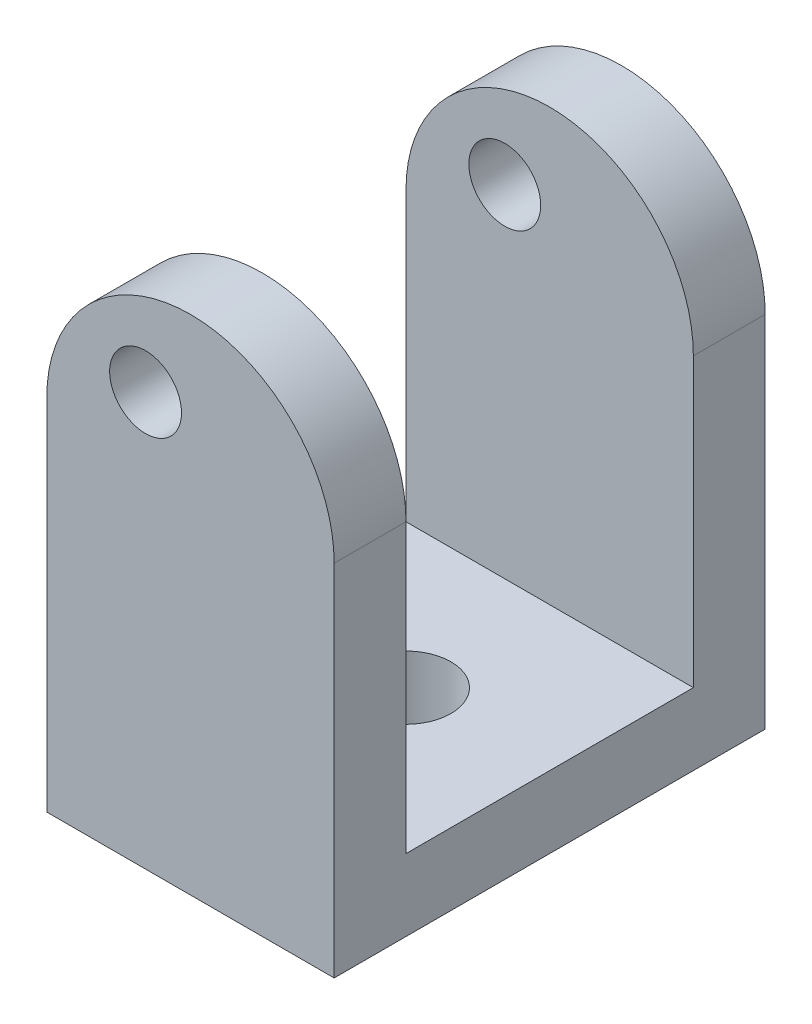
ISO-10303-21;
HEADER;
FILE_DESCRIPTION(('STEP AP214'),'2;1');
FILE_NAME('part.step','',(''),(''),'','','');
FILE_SCHEMA(('AUTOMOTIVE_DESIGN { 1 0 10303 214 1 1 1 1 }'));
ENDSEC;
DATA;
#1=APPLICATION_CONTEXT('core data for automotive mechanical design processes');
#2=APPLICATION_PROTOCOL_DEFINITION('international standard','automotive_design',2000,#1);
#3=PRODUCT_CONTEXT('',#1,'mechanical');
#4=PRODUCT('Part','Part','',(#3));
#5=PRODUCT_RELATED_PRODUCT_CATEGORY('part','',(#4));
#6=PRODUCT_DEFINITION_FORMATION('','',#4);
#7=PRODUCT_DEFINITION_CONTEXT('part definition',#1,'design');
#8=PRODUCT_DEFINITION('design','',#6,#7);
#9=PRODUCT_DEFINITION_SHAPE('','',#8);
#10=(LENGTH_UNIT() NAMED_UNIT(*) SI_UNIT(.MILLI.,.METRE.));
#11=(NAMED_UNIT(*) PLANE_ANGLE_UNIT() SI_UNIT($,.RADIAN.));
#12=(NAMED_UNIT(*) SI_UNIT($,.STERADIAN.) SOLID_ANGLE_UNIT());
#13=UNCERTAINTY_MEASURE_WITH_UNIT(LENGTH_MEASURE(1.E-05),#10,'distance_accuracy_value','');
#14=(GEOMETRIC_REPRESENTATION_CONTEXT(3) GLOBAL_UNCERTAINTY_ASSIGNED_CONTEXT((#13)) GLOBAL_UNIT_ASSIGNED_CONTEXT((#10,
#11,#12)) REPRESENTATION_CONTEXT('',''));
#15=CARTESIAN_POINT('',(0.,0.,0.));
#16=DIRECTION('',(0.,0.,1.));
#17=DIRECTION('',(1.,0.,0.));
#18=AXIS2_PLACEMENT_3D('',#15,#16,#17);
#19=CARTESIAN_POINT('',(-28.575,50.8,19.05));
#20=DIRECTION('',(1.,0.,0.));
#21=DIRECTION('',(0.,0.,-1.));
#22=AXIS2_PLACEMENT_3D('',#19,#20,#21);
#23=PLANE('',#22);
#24=DIRECTION('',(0.,0.,1.));
#25=VECTOR('',#24,1.);
#26=CARTESIAN_POINT('',(-28.575,31.75,-19.05));
#27=LINE('',#26,#25);
#28=CARTESIAN_POINT('',(-28.575,31.75,-19.05));
#29=VERTEX_POINT('',#28);
#30=CARTESIAN_POINT('',(-28.575,31.75,-12.7));
#31=VERTEX_POINT('',#30);
#32=EDGE_CURVE('E125',#29,#31,#27,.T.);
#33=ORIENTED_EDGE('',*,*,#32,.F.);
#34=DIRECTION('',(0.,-1.,0.));
#35=VECTOR('',#34,1.);
#36=CARTESIAN_POINT('',(-28.575,50.8,-19.05));
#37=LINE('',#36,#35);
#38=CARTESIAN_POINT('',(-28.575,0.,-19.05));
#39=VERTEX_POINT('',#38);
#40=EDGE_CURVE('E137',#29,#39,#37,.T.);
#41=ORIENTED_EDGE('',*,*,#40,.T.);
#42=DIRECTION('',(0.,0.,1.));
#43=VECTOR('',#42,1.);
#44=CARTESIAN_POINT('',(-28.575,0.,19.05));
#45=LINE('',#44,#43);
#46=CARTESIAN_POINT('',(-28.575,0.,19.05));
#47=VERTEX_POINT('',#46);
#48=EDGE_CURVE('E184',#39,#47,#45,.T.);
#49=ORIENTED_EDGE('',*,*,#48,.T.);
#50=DIRECTION('',(0.,-1.,0.));
#51=VECTOR('',#50,1.);
#52=CARTESIAN_POINT('',(-28.575,50.8,19.05));
#53=LINE('',#52,#51);
#54=CARTESIAN_POINT('',(-28.575,31.75,19.05));
#55=VERTEX_POINT('',#54);
#56=EDGE_CURVE('E79',#55,#47,#53,.T.);
#57=ORIENTED_EDGE('',*,*,#56,.F.);
#58=CARTESIAN_POINT('',(-28.575,31.75,12.7));
#59=VERTEX_POINT('',#58);
#60=EDGE_CURVE('E142',#59,#55,#27,.T.);
#61=ORIENTED_EDGE('',*,*,#60,.F.);
#62=DIRECTION('',(0.,1.,0.));
#63=VECTOR('',#62,1.);
#64=CARTESIAN_POINT('',(-28.575,50.8,12.7));
#65=LINE('',#64,#63);
#66=CARTESIAN_POINT('',(-28.575,6.35,12.7));
#67=VERTEX_POINT('',#66);
#68=EDGE_CURVE('E175',#67,#59,#65,.T.);
#69=ORIENTED_EDGE('',*,*,#68,.F.);
#70=DIRECTION('',(0.,0.,1.));
#71=VECTOR('',#70,1.);
#72=CARTESIAN_POINT('',(-28.575,6.35,-12.7));
#73=LINE('',#72,#71);
#74=CARTESIAN_POINT('',(-28.575,6.35,-12.7));
#75=VERTEX_POINT('',#74);
#76=EDGE_CURVE('E172',#75,#67,#73,.T.);
#77=ORIENTED_EDGE('',*,*,#76,.F.);
#78=DIRECTION('',(0.,-1.,0.));
#79=VECTOR('',#78,1.);
#80=CARTESIAN_POINT('',(-28.575,50.8,-12.7));
#81=LINE('',#80,#79);
#82=EDGE_CURVE('E140',#31,#75,#81,.T.);
#83=ORIENTED_EDGE('',*,*,#82,.F.);
#84=EDGE_LOOP('',(#33,#41,#49,#57,#61,#69,#77,#83));
#85=FACE_BOUND('',#84,.T.);
#86=ADVANCED_FACE('F55',(#85),#23,.F.);
#87=CARTESIAN_POINT('',(-28.575,50.8,-19.05));
#88=DIRECTION('',(0.,0.,1.));
#89=DIRECTION('',(1.,0.,0.));
#90=AXIS2_PLACEMENT_3D('',#87,#88,#89);
#91=PLANE('',#90);
#92=CARTESIAN_POINT('',(-19.84375,36.5125,-19.05));
#93=DIRECTION('',(0.,0.,1.));
#94=DIRECTION('',(1.,0.,0.));
#95=AXIS2_PLACEMENT_3D('',#92,#93,#94);
#96=CIRCLE('',#95,3.175);
#97=CARTESIAN_POINT('',(-16.66875,36.5125,-19.05));
#98=VERTEX_POINT('',#97);
#99=EDGE_CURVE('E166',#98,#98,#96,.T.);
#100=ORIENTED_EDGE('',*,*,#99,.T.);
#101=EDGE_LOOP('',(#100));
#102=FACE_BOUND('',#101,.T.);
#103=CARTESIAN_POINT('',(-15.875,31.75,-19.05));
#104=DIRECTION('',(0.,0.,1.));
#105=DIRECTION('',(1.,0.,0.));
#106=AXIS2_PLACEMENT_3D('',#103,#104,#105);
#107=CIRCLE('',#106,12.7);
#108=CARTESIAN_POINT('',(-3.17500000000001,31.75,-19.05));
#109=VERTEX_POINT('',#108);
#110=EDGE_CURVE('E122',#109,#29,#107,.T.);
#111=ORIENTED_EDGE('',*,*,#110,.F.);
#112=DIRECTION('',(0.,-1.,0.));
#113=VECTOR('',#112,1.);
#114=CARTESIAN_POINT('',(-3.175,0.,-19.05));
#115=LINE('',#114,#113);
#116=CARTESIAN_POINT('',(-3.17500000000001,0.,-19.05));
#117=VERTEX_POINT('',#116);
#118=EDGE_CURVE('E132',#109,#117,#115,.T.);
#119=ORIENTED_EDGE('',*,*,#118,.T.);
#120=DIRECTION('',(-1.,0.,0.));
#121=VECTOR('',#120,1.);
#122=CARTESIAN_POINT('',(-28.575,0.,-19.05));
#123=LINE('',#122,#121);
#124=EDGE_CURVE('E145',#117,#39,#123,.T.);
#125=ORIENTED_EDGE('',*,*,#124,.T.);
#126=ORIENTED_EDGE('',*,*,#40,.F.);
#127=EDGE_LOOP('',(#111,#119,#125,#126));
#128=FACE_BOUND('',#127,.T.);
#129=ADVANCED_FACE('F57',(#102,#128),#91,.F.);
#130=CARTESIAN_POINT('',(-28.575,50.8,19.05));
#131=DIRECTION('',(0.,0.,-1.));
#132=DIRECTION('',(-1.,0.,0.));
#133=AXIS2_PLACEMENT_3D('',#130,#131,#132);
#134=PLANE('',#133);
#135=CARTESIAN_POINT('',(-19.84375,36.5125,19.05));
#136=DIRECTION('',(0.,0.,1.));
#137=DIRECTION('',(1.,0.,0.));
#138=AXIS2_PLACEMENT_3D('',#135,#136,#137);
#139=CIRCLE('',#138,3.175);
#140=CARTESIAN_POINT('',(-16.66875,36.5125,19.05));
#141=VERTEX_POINT('',#140);
#142=EDGE_CURVE('E192',#141,#141,#139,.T.);
#143=ORIENTED_EDGE('',*,*,#142,.F.);
#144=EDGE_LOOP('',(#143));
#145=FACE_BOUND('',#144,.T.);
#146=DIRECTION('',(1.,0.,0.));
#147=VECTOR('',#146,1.);
#148=CARTESIAN_POINT('',(-28.575,0.,19.05));
#149=LINE('',#148,#147);
#150=CARTESIAN_POINT('',(-3.17500000000001,0.,19.05));
#151=VERTEX_POINT('',#150);
#152=EDGE_CURVE('E149',#47,#151,#149,.T.);
#153=ORIENTED_EDGE('',*,*,#152,.T.);
#154=DIRECTION('',(0.,-1.,0.));
#155=VECTOR('',#154,1.);
#156=CARTESIAN_POINT('',(-3.175,0.,19.05));
#157=LINE('',#156,#155);
#158=CARTESIAN_POINT('',(-3.17500000000001,31.75,19.05));
#159=VERTEX_POINT('',#158);
#160=EDGE_CURVE('E133',#159,#151,#157,.T.);
#161=ORIENTED_EDGE('',*,*,#160,.F.);
#162=CARTESIAN_POINT('',(-15.875,31.75,19.05));
#163=DIRECTION('',(0.,0.,1.));
#164=DIRECTION('',(1.,0.,0.));
#165=AXIS2_PLACEMENT_3D('',#162,#163,#164);
#166=CIRCLE('',#165,12.7);
#167=EDGE_CURVE('E227',#159,#55,#166,.T.);
#168=ORIENTED_EDGE('',*,*,#167,.T.);
#169=ORIENTED_EDGE('',*,*,#56,.T.);
#170=EDGE_LOOP('',(#153,#161,#168,#169));
#171=FACE_BOUND('',#170,.T.);
#172=ADVANCED_FACE('F187',(#145,#171),#134,.F.);
#173=CARTESIAN_POINT('',(0.,0.,0.));
#174=DIRECTION('',(0.,-1.,0.));
#175=DIRECTION('',(0.,0.,-1.));
#176=AXIS2_PLACEMENT_3D('',#173,#174,#175);
#177=PLANE('',#176);
#178=CARTESIAN_POINT('',(-15.875,0.,0.));
#179=DIRECTION('',(0.,-1.,0.));
#180=DIRECTION('',(0.,0.,-1.));
#181=AXIS2_PLACEMENT_3D('',#178,#179,#180);
#182=CIRCLE('',#181,3.96875);
#183=CARTESIAN_POINT('',(-15.875,0.,-3.96875));
#184=VERTEX_POINT('',#183);
#185=EDGE_CURVE('E229',#184,#184,#182,.T.);
#186=ORIENTED_EDGE('',*,*,#185,.F.);
#187=EDGE_LOOP('',(#186));
#188=FACE_BOUND('',#187,.T.);
#189=DIRECTION('',(0.,0.,1.));
#190=VECTOR('',#189,1.);
#191=CARTESIAN_POINT('',(-3.17500000000001,0.,-19.05));
#192=LINE('',#191,#190);
#193=EDGE_CURVE('E191',#117,#151,#192,.T.);
#194=ORIENTED_EDGE('',*,*,#193,.T.);
#195=ORIENTED_EDGE('',*,*,#152,.F.);
#196=ORIENTED_EDGE('',*,*,#48,.F.);
#197=ORIENTED_EDGE('',*,*,#124,.F.);
#198=EDGE_LOOP('',(#194,#195,#196,#197));
#199=FACE_BOUND('',#198,.T.);
#200=ADVANCED_FACE('F190',(#188,#199),#177,.T.);
#201=CARTESIAN_POINT('',(28.575,50.8,-12.7));
#202=DIRECTION('',(0.,0.,-1.));
#203=DIRECTION('',(0.,1.,0.));
#204=AXIS2_PLACEMENT_3D('',#201,#202,#203);
#205=PLANE('',#204);
#206=CARTESIAN_POINT('',(-19.84375,36.5125,-12.7));
#207=DIRECTION('',(0.,0.,-1.));
#208=DIRECTION('',(0.,1.,0.));
#209=AXIS2_PLACEMENT_3D('',#206,#207,#208);
#210=CIRCLE('',#209,3.175);
#211=CARTESIAN_POINT('',(-19.84375,39.6875,-12.7));
#212=VERTEX_POINT('',#211);
#213=EDGE_CURVE('E155',#212,#212,#210,.T.);
#214=ORIENTED_EDGE('',*,*,#213,.T.);
#215=EDGE_LOOP('',(#214));
#216=FACE_BOUND('',#215,.T.);
#217=DIRECTION('',(-1.,0.,0.));
#218=VECTOR('',#217,1.);
#219=CARTESIAN_POINT('',(28.575,6.35,-12.7));
#220=LINE('',#219,#218);
#221=CARTESIAN_POINT('',(-3.17499999999999,6.35,-12.7));
#222=VERTEX_POINT('',#221);
#223=EDGE_CURVE('E178',#222,#75,#220,.T.);
#224=ORIENTED_EDGE('',*,*,#223,.F.);
#225=DIRECTION('',(0.,1.,0.));
#226=VECTOR('',#225,1.);
#227=CARTESIAN_POINT('',(-3.17500000000002,50.8,-12.7));
#228=LINE('',#227,#226);
#229=CARTESIAN_POINT('',(-3.17500000000001,31.75,-12.7));
#230=VERTEX_POINT('',#229);
#231=EDGE_CURVE('E71',#222,#230,#228,.T.);
#232=ORIENTED_EDGE('',*,*,#231,.T.);
#233=CARTESIAN_POINT('',(-15.875,31.75,-12.7));
#234=DIRECTION('',(0.,0.,-1.));
#235=DIRECTION('',(0.,1.,0.));
#236=AXIS2_PLACEMENT_3D('',#233,#234,#235);
#237=CIRCLE('',#236,12.7);
#238=EDGE_CURVE('E159',#31,#230,#237,.T.);
#239=ORIENTED_EDGE('',*,*,#238,.F.);
#240=ORIENTED_EDGE('',*,*,#82,.T.);
#241=EDGE_LOOP('',(#224,#232,#239,#240));
#242=FACE_BOUND('',#241,.T.);
#243=ADVANCED_FACE('F211',(#216,#242),#205,.F.);
#244=CARTESIAN_POINT('',(28.575,50.8,12.7));
#245=DIRECTION('',(0.,0.,1.));
#246=DIRECTION('',(0.,-1.,0.));
#247=AXIS2_PLACEMENT_3D('',#244,#245,#246);
#248=PLANE('',#247);
#249=CARTESIAN_POINT('',(-19.84375,36.5125,12.7));
#250=DIRECTION('',(0.,0.,1.));
#251=DIRECTION('',(0.,-1.,0.));
#252=AXIS2_PLACEMENT_3D('',#249,#250,#251);
#253=CIRCLE('',#252,3.175);
#254=CARTESIAN_POINT('',(-19.84375,33.3375,12.7));
#255=VERTEX_POINT('',#254);
#256=EDGE_CURVE('E153',#255,#255,#253,.T.);
#257=ORIENTED_EDGE('',*,*,#256,.T.);
#258=EDGE_LOOP('',(#257));
#259=FACE_BOUND('',#258,.T.);
#260=CARTESIAN_POINT('',(-15.875,31.75,12.7));
#261=DIRECTION('',(0.,0.,1.));
#262=DIRECTION('',(0.,-1.,0.));
#263=AXIS2_PLACEMENT_3D('',#260,#261,#262);
#264=CIRCLE('',#263,12.7);
#265=CARTESIAN_POINT('',(-3.17500000000001,31.75,12.7));
#266=VERTEX_POINT('',#265);
#267=EDGE_CURVE('E12',#266,#59,#264,.T.);
#268=ORIENTED_EDGE('',*,*,#267,.F.);
#269=DIRECTION('',(0.,-1.,0.));
#270=VECTOR('',#269,1.);
#271=CARTESIAN_POINT('',(-3.17500000000002,50.8,12.7));
#272=LINE('',#271,#270);
#273=CARTESIAN_POINT('',(-3.175,6.35,12.7));
#274=VERTEX_POINT('',#273);
#275=EDGE_CURVE('E161',#266,#274,#272,.T.);
#276=ORIENTED_EDGE('',*,*,#275,.T.);
#277=DIRECTION('',(-1.,0.,0.));
#278=VECTOR('',#277,1.);
#279=CARTESIAN_POINT('',(28.575,6.35,12.7));
#280=LINE('',#279,#278);
#281=EDGE_CURVE('E179',#274,#67,#280,.T.);
#282=ORIENTED_EDGE('',*,*,#281,.T.);
#283=ORIENTED_EDGE('',*,*,#68,.T.);
#284=EDGE_LOOP('',(#268,#276,#282,#283));
#285=FACE_BOUND('',#284,.T.);
#286=ADVANCED_FACE('F213',(#259,#285),#248,.F.);
#287=CARTESIAN_POINT('',(28.575,6.35,-12.7));
#288=DIRECTION('',(0.,-1.,0.));
#289=DIRECTION('',(0.,0.,-1.));
#290=AXIS2_PLACEMENT_3D('',#287,#288,#289);
#291=PLANE('',#290);
#292=CARTESIAN_POINT('',(-15.875,6.35,0.));
#293=DIRECTION('',(0.,-1.,0.));
#294=DIRECTION('',(0.,0.,-1.));
#295=AXIS2_PLACEMENT_3D('',#292,#293,#294);
#296=CIRCLE('',#295,3.96875);
#297=CARTESIAN_POINT('',(-15.875,6.35,-3.96875));
#298=VERTEX_POINT('',#297);
#299=EDGE_CURVE('E59',#298,#298,#296,.T.);
#300=ORIENTED_EDGE('',*,*,#299,.T.);
#301=EDGE_LOOP('',(#300));
#302=FACE_BOUND('',#301,.T.);
#303=ORIENTED_EDGE('',*,*,#281,.F.);
#304=DIRECTION('',(0.,0.,-1.));
#305=VECTOR('',#304,1.);
#306=CARTESIAN_POINT('',(-3.175,6.35,-12.7));
#307=LINE('',#306,#305);
#308=EDGE_CURVE('E64',#274,#222,#307,.T.);
#309=ORIENTED_EDGE('',*,*,#308,.T.);
#310=ORIENTED_EDGE('',*,*,#223,.T.);
#311=ORIENTED_EDGE('',*,*,#76,.T.);
#312=EDGE_LOOP('',(#303,#309,#310,#311));
#313=FACE_BOUND('',#312,.T.);
#314=ADVANCED_FACE('F217',(#302,#313),#291,.F.);
#315=CARTESIAN_POINT('',(-15.875,31.75,-19.05));
#316=DIRECTION('',(0.,0.,1.));
#317=DIRECTION('',(1.,0.,0.));
#318=AXIS2_PLACEMENT_3D('',#315,#316,#317);
#319=CYLINDRICAL_SURFACE('',#318,12.7);
#320=ORIENTED_EDGE('',*,*,#238,.T.);
#321=DIRECTION('',(0.,0.,1.));
#322=VECTOR('',#321,1.);
#323=CARTESIAN_POINT('',(-3.17500000000001,31.75,-19.05));
#324=LINE('',#323,#322);
#325=EDGE_CURVE('E127',#109,#230,#324,.T.);
#326=ORIENTED_EDGE('',*,*,#325,.F.);
#327=ORIENTED_EDGE('',*,*,#110,.T.);
#328=ORIENTED_EDGE('',*,*,#32,.T.);
#329=EDGE_LOOP('',(#320,#326,#327,#328));
#330=FACE_BOUND('',#329,.T.);
#331=ADVANCED_FACE('F124',(#330),#319,.T.);
#332=ORIENTED_EDGE('',*,*,#267,.T.);
#333=ORIENTED_EDGE('',*,*,#60,.T.);
#334=ORIENTED_EDGE('',*,*,#167,.F.);
#335=EDGE_CURVE('E141',#266,#159,#324,.T.);
#336=ORIENTED_EDGE('',*,*,#335,.F.);
#337=EDGE_LOOP('',(#332,#333,#334,#336));
#338=FACE_BOUND('',#337,.T.);
#339=ADVANCED_FACE('F226',(#338),#319,.T.);
#340=CARTESIAN_POINT('',(-3.175,0.,-19.05));
#341=DIRECTION('',(-1.,0.,0.));
#342=DIRECTION('',(0.,-1.,0.));
#343=AXIS2_PLACEMENT_3D('',#340,#341,#342);
#344=PLANE('',#343);
#345=ORIENTED_EDGE('',*,*,#308,.F.);
#346=ORIENTED_EDGE('',*,*,#275,.F.);
#347=ORIENTED_EDGE('',*,*,#335,.T.);
#348=ORIENTED_EDGE('',*,*,#160,.T.);
#349=ORIENTED_EDGE('',*,*,#193,.F.);
#350=ORIENTED_EDGE('',*,*,#118,.F.);
#351=ORIENTED_EDGE('',*,*,#325,.T.);
#352=ORIENTED_EDGE('',*,*,#231,.F.);
#353=EDGE_LOOP('',(#345,#346,#347,#348,#349,#350,#351,#352));
#354=FACE_BOUND('',#353,.T.);
#355=ADVANCED_FACE('F223',(#354),#344,.F.);
#356=CARTESIAN_POINT('',(-19.84375,36.5125,-19.05));
#357=DIRECTION('',(0.,0.,1.));
#358=DIRECTION('',(1.,0.,0.));
#359=AXIS2_PLACEMENT_3D('',#356,#357,#358);
#360=CYLINDRICAL_SURFACE('',#359,3.175);
#361=ORIENTED_EDGE('',*,*,#142,.T.);
#362=EDGE_LOOP('',(#361));
#363=FACE_BOUND('',#362,.T.);
#364=ORIENTED_EDGE('',*,*,#256,.F.);
#365=EDGE_LOOP('',(#364));
#366=FACE_BOUND('',#365,.T.);
#367=ADVANCED_FACE('F207',(#363,#366),#360,.F.);
#368=ORIENTED_EDGE('',*,*,#99,.F.);
#369=EDGE_LOOP('',(#368));
#370=FACE_BOUND('',#369,.T.);
#371=ORIENTED_EDGE('',*,*,#213,.F.);
#372=EDGE_LOOP('',(#371));
#373=FACE_BOUND('',#372,.T.);
#374=ADVANCED_FACE('F203',(#370,#373),#360,.F.);
#375=CARTESIAN_POINT('',(-15.875,44.45,0.));
#376=DIRECTION('',(0.,-1.,0.));
#377=DIRECTION('',(0.,0.,-1.));
#378=AXIS2_PLACEMENT_3D('',#375,#376,#377);
#379=CYLINDRICAL_SURFACE('',#378,3.96875);
#380=ORIENTED_EDGE('',*,*,#185,.T.);
#381=EDGE_LOOP('',(#380));
#382=FACE_BOUND('',#381,.T.);
#383=ORIENTED_EDGE('',*,*,#299,.F.);
#384=EDGE_LOOP('',(#383));
#385=FACE_BOUND('',#384,.T.);
#386=ADVANCED_FACE('F206',(#382,#385),#379,.F.);
#387=CLOSED_SHELL('',(#86,#129,#172,#200,#243,#286,#314,#331,#339,#355,#367,#374,#386));
#388=MANIFOLD_SOLID_BREP('B2',#387);
#389=ADVANCED_BREP_SHAPE_REPRESENTATION('',(#18,#388),#14);
#390=SHAPE_DEFINITION_REPRESENTATION(#9,#389);
ENDSEC;
END-ISO-10303-21;
